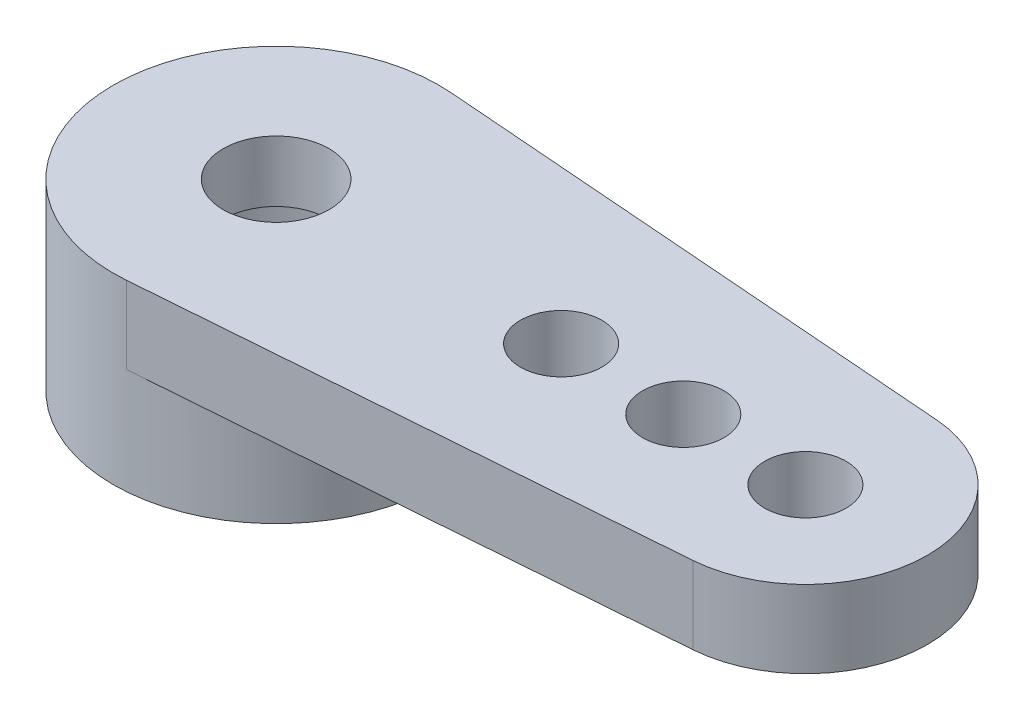
ISO-10303-21;
HEADER;
FILE_DESCRIPTION(('STEP AP214'),'2;1');
FILE_NAME('part.step','',(''),(''),'','','');
FILE_SCHEMA(('AUTOMOTIVE_DESIGN { 1 0 10303 214 1 1 1 1 }'));
ENDSEC;
DATA;
#1=APPLICATION_CONTEXT('core data for automotive mechanical design processes');
#2=APPLICATION_PROTOCOL_DEFINITION('international standard','automotive_design',2000,#1);
#3=PRODUCT_CONTEXT('',#1,'mechanical');
#4=PRODUCT('Part','Part','',(#3));
#5=PRODUCT_RELATED_PRODUCT_CATEGORY('part','',(#4));
#6=PRODUCT_DEFINITION_FORMATION('','',#4);
#7=PRODUCT_DEFINITION_CONTEXT('part definition',#1,'design');
#8=PRODUCT_DEFINITION('design','',#6,#7);
#9=PRODUCT_DEFINITION_SHAPE('','',#8);
#10=(LENGTH_UNIT() NAMED_UNIT(*) SI_UNIT(.MILLI.,.METRE.));
#11=(NAMED_UNIT(*) PLANE_ANGLE_UNIT() SI_UNIT($,.RADIAN.));
#12=(NAMED_UNIT(*) SI_UNIT($,.STERADIAN.) SOLID_ANGLE_UNIT());
#13=UNCERTAINTY_MEASURE_WITH_UNIT(LENGTH_MEASURE(1.E-05),#10,'distance_accuracy_value','');
#14=(GEOMETRIC_REPRESENTATION_CONTEXT(3) GLOBAL_UNCERTAINTY_ASSIGNED_CONTEXT((#13)) GLOBAL_UNIT_ASSIGNED_CONTEXT((#10,
#11,#12)) REPRESENTATION_CONTEXT('',''));
#15=CARTESIAN_POINT('',(0.,0.,0.));
#16=DIRECTION('',(0.,0.,1.));
#17=DIRECTION('',(1.,0.,0.));
#18=AXIS2_PLACEMENT_3D('',#15,#16,#17);
#19=CARTESIAN_POINT('',(0.,4.5,0.));
#20=DIRECTION('',(0.,-1.,0.));
#21=DIRECTION('',(0.,0.,-1.));
#22=AXIS2_PLACEMENT_3D('',#19,#20,#21);
#23=CYLINDRICAL_SURFACE('',#22,1.3);
#24=CARTESIAN_POINT('',(0.,4.5,0.));
#25=DIRECTION('',(0.,1.,0.));
#26=DIRECTION('',(0.,0.,1.));
#27=AXIS2_PLACEMENT_3D('',#24,#25,#26);
#28=CIRCLE('',#27,1.3);
#29=CARTESIAN_POINT('',(0.,4.5,1.3));
#30=VERTEX_POINT('',#29);
#31=EDGE_CURVE('E135',#30,#30,#28,.T.);
#32=ORIENTED_EDGE('',*,*,#31,.T.);
#33=EDGE_LOOP('',(#32));
#34=FACE_BOUND('',#33,.T.);
#35=CARTESIAN_POINT('',(0.,3.,0.));
#36=DIRECTION('',(0.,-1.,0.));
#37=DIRECTION('',(0.,0.,-1.));
#38=AXIS2_PLACEMENT_3D('',#35,#36,#37);
#39=CIRCLE('',#38,1.3);
#40=CARTESIAN_POINT('',(0.,3.,-1.3));
#41=VERTEX_POINT('',#40);
#42=EDGE_CURVE('E47',#41,#41,#39,.T.);
#43=ORIENTED_EDGE('',*,*,#42,.T.);
#44=EDGE_LOOP('',(#43));
#45=FACE_BOUND('',#44,.T.);
#46=ADVANCED_FACE('F43',(#34,#45),#23,.F.);
#47=CARTESIAN_POINT('',(0.,4.5,0.));
#48=DIRECTION('',(0.,1.,0.));
#49=DIRECTION('',(0.,0.,1.));
#50=AXIS2_PLACEMENT_3D('',#47,#48,#49);
#51=PLANE('',#50);
#52=CARTESIAN_POINT('',(0.,4.5,0.));
#53=DIRECTION('',(0.,1.,0.));
#54=DIRECTION('',(0.,0.,1.));
#55=AXIS2_PLACEMENT_3D('',#52,#53,#54);
#56=CIRCLE('',#55,4.);
#57=CARTESIAN_POINT('',(0.307692307692308,4.5,-3.98814812209715));
#58=VERTEX_POINT('',#57);
#59=CARTESIAN_POINT('',(0.307692307692308,4.5,3.98814812209715));
#60=VERTEX_POINT('',#59);
#61=EDGE_CURVE('E11',#58,#60,#56,.T.);
#62=ORIENTED_EDGE('',*,*,#61,.T.);
#63=DIRECTION('',(0.997037030524286,0.,-0.076923076923077));
#64=VECTOR('',#63,1.);
#65=CARTESIAN_POINT('',(0.307692307692308,4.5,3.98814812209715));
#66=LINE('',#65,#64);
#67=CARTESIAN_POINT('',(13.2307692307692,4.5,2.99111109157286));
#68=VERTEX_POINT('',#67);
#69=EDGE_CURVE('E99',#60,#68,#66,.T.);
#70=ORIENTED_EDGE('',*,*,#69,.T.);
#71=CARTESIAN_POINT('',(13.,4.5,0.));
#72=DIRECTION('',(0.,1.,0.));
#73=DIRECTION('',(0.,0.,1.));
#74=AXIS2_PLACEMENT_3D('',#71,#72,#73);
#75=CIRCLE('',#74,3.);
#76=CARTESIAN_POINT('',(13.2307692307692,4.5,-2.99111109157286));
#77=VERTEX_POINT('',#76);
#78=EDGE_CURVE('E128',#68,#77,#75,.T.);
#79=ORIENTED_EDGE('',*,*,#78,.T.);
#80=DIRECTION('',(0.997037030524286,0.,0.076923076923077));
#81=VECTOR('',#80,1.);
#82=CARTESIAN_POINT('',(0.307692307692308,4.5,-3.98814812209715));
#83=LINE('',#82,#81);
#84=EDGE_CURVE('E59',#58,#77,#83,.T.);
#85=ORIENTED_EDGE('',*,*,#84,.F.);
#86=EDGE_LOOP('',(#62,#70,#79,#85));
#87=FACE_BOUND('',#86,.T.);
#88=ORIENTED_EDGE('',*,*,#31,.F.);
#89=EDGE_LOOP('',(#88));
#90=FACE_BOUND('',#89,.T.);
#91=CARTESIAN_POINT('',(10.,4.5,0.));
#92=DIRECTION('',(0.,1.,0.));
#93=DIRECTION('',(0.,0.,1.));
#94=AXIS2_PLACEMENT_3D('',#91,#92,#93);
#95=CIRCLE('',#94,1.);
#96=CARTESIAN_POINT('',(10.,4.5,1.));
#97=VERTEX_POINT('',#96);
#98=EDGE_CURVE('E120',#97,#97,#95,.T.);
#99=ORIENTED_EDGE('',*,*,#98,.F.);
#100=EDGE_LOOP('',(#99));
#101=FACE_BOUND('',#100,.T.);
#102=CARTESIAN_POINT('',(7.,4.5,0.));
#103=DIRECTION('',(0.,1.,0.));
#104=DIRECTION('',(0.,0.,1.));
#105=AXIS2_PLACEMENT_3D('',#102,#103,#104);
#106=CIRCLE('',#105,1.);
#107=CARTESIAN_POINT('',(7.,4.5,1.));
#108=VERTEX_POINT('',#107);
#109=EDGE_CURVE('E123',#108,#108,#106,.T.);
#110=ORIENTED_EDGE('',*,*,#109,.F.);
#111=EDGE_LOOP('',(#110));
#112=FACE_BOUND('',#111,.T.);
#113=CARTESIAN_POINT('',(13.,4.5,0.));
#114=DIRECTION('',(0.,1.,0.));
#115=DIRECTION('',(0.,0.,1.));
#116=AXIS2_PLACEMENT_3D('',#113,#114,#115);
#117=CIRCLE('',#116,1.);
#118=CARTESIAN_POINT('',(13.,4.5,1.));
#119=VERTEX_POINT('',#118);
#120=EDGE_CURVE('E130',#119,#119,#117,.T.);
#121=ORIENTED_EDGE('',*,*,#120,.F.);
#122=EDGE_LOOP('',(#121));
#123=FACE_BOUND('',#122,.T.);
#124=ADVANCED_FACE('F144',(#87,#90,#101,#112,#123),#51,.T.);
#125=CARTESIAN_POINT('',(0.,0.,0.));
#126=DIRECTION('',(0.,1.,0.));
#127=DIRECTION('',(0.,0.,1.));
#128=AXIS2_PLACEMENT_3D('',#125,#126,#127);
#129=PLANE('',#128);
#130=CARTESIAN_POINT('',(0.,0.,0.));
#131=DIRECTION('',(0.,-1.,0.));
#132=DIRECTION('',(0.,0.,-1.));
#133=AXIS2_PLACEMENT_3D('',#130,#131,#132);
#134=CIRCLE('',#133,3.);
#135=CARTESIAN_POINT('',(0.,0.,-3.));
#136=VERTEX_POINT('',#135);
#137=EDGE_CURVE('E198',#136,#136,#134,.T.);
#138=ORIENTED_EDGE('',*,*,#137,.F.);
#139=EDGE_LOOP('',(#138));
#140=FACE_BOUND('',#139,.T.);
#141=CARTESIAN_POINT('',(0.,0.,0.));
#142=DIRECTION('',(0.,1.,0.));
#143=DIRECTION('',(0.,0.,1.));
#144=AXIS2_PLACEMENT_3D('',#141,#142,#143);
#145=CIRCLE('',#144,4.);
#146=CARTESIAN_POINT('',(0.,0.,4.));
#147=VERTEX_POINT('',#146);
#148=EDGE_CURVE('E52',#147,#147,#145,.T.);
#149=ORIENTED_EDGE('',*,*,#148,.F.);
#150=EDGE_LOOP('',(#149));
#151=FACE_BOUND('',#150,.T.);
#152=ADVANCED_FACE('F142',(#140,#151),#129,.F.);
#153=CARTESIAN_POINT('',(0.,4.5,0.));
#154=DIRECTION('',(0.,-1.,0.));
#155=DIRECTION('',(0.,0.,-1.));
#156=AXIS2_PLACEMENT_3D('',#153,#154,#155);
#157=CYLINDRICAL_SURFACE('',#156,4.);
#158=ORIENTED_EDGE('',*,*,#61,.F.);
#159=DIRECTION('',(0.,1.,0.));
#160=VECTOR('',#159,1.);
#161=CARTESIAN_POINT('',(0.307692307692308,2.6,-3.98814812209715));
#162=LINE('',#161,#160);
#163=CARTESIAN_POINT('',(0.307692307692308,2.6,-3.98814812209715));
#164=VERTEX_POINT('',#163);
#165=EDGE_CURVE('E103',#164,#58,#162,.T.);
#166=ORIENTED_EDGE('',*,*,#165,.F.);
#167=CARTESIAN_POINT('',(0.,2.6,0.));
#168=DIRECTION('',(0.,1.,0.));
#169=DIRECTION('',(0.,0.,1.));
#170=AXIS2_PLACEMENT_3D('',#167,#168,#169);
#171=CIRCLE('',#170,4.);
#172=CARTESIAN_POINT('',(0.307692307692308,2.6,3.98814812209715));
#173=VERTEX_POINT('',#172);
#174=EDGE_CURVE('E90',#173,#164,#171,.T.);
#175=ORIENTED_EDGE('',*,*,#174,.F.);
#176=DIRECTION('',(0.,1.,0.));
#177=VECTOR('',#176,1.);
#178=CARTESIAN_POINT('',(0.307692307692308,2.6,3.98814812209715));
#179=LINE('',#178,#177);
#180=EDGE_CURVE('E95',#173,#60,#179,.T.);
#181=ORIENTED_EDGE('',*,*,#180,.T.);
#182=EDGE_LOOP('',(#158,#166,#175,#181));
#183=FACE_BOUND('',#182,.T.);
#184=ORIENTED_EDGE('',*,*,#148,.T.);
#185=EDGE_LOOP('',(#184));
#186=FACE_BOUND('',#185,.T.);
#187=ADVANCED_FACE('F45',(#183,#186),#157,.T.);
#188=CARTESIAN_POINT('',(0.307692307692308,2.6,-3.98814812209715));
#189=DIRECTION('',(-0.076923076923077,0.,0.997037030524286));
#190=DIRECTION('',(0.997037030524286,0.,0.076923076923077));
#191=AXIS2_PLACEMENT_3D('',#188,#189,#190);
#192=PLANE('',#191);
#193=ORIENTED_EDGE('',*,*,#84,.T.);
#194=DIRECTION('',(0.,1.,0.));
#195=VECTOR('',#194,1.);
#196=CARTESIAN_POINT('',(13.2307692307692,2.6,-2.99111109157286));
#197=LINE('',#196,#195);
#198=CARTESIAN_POINT('',(13.2307692307692,2.6,-2.99111109157286));
#199=VERTEX_POINT('',#198);
#200=EDGE_CURVE('E86',#199,#77,#197,.T.);
#201=ORIENTED_EDGE('',*,*,#200,.F.);
#202=DIRECTION('',(0.997037030524286,0.,0.076923076923077));
#203=VECTOR('',#202,1.);
#204=CARTESIAN_POINT('',(0.307692307692308,2.6,-3.98814812209715));
#205=LINE('',#204,#203);
#206=EDGE_CURVE('E68',#164,#199,#205,.T.);
#207=ORIENTED_EDGE('',*,*,#206,.F.);
#208=ORIENTED_EDGE('',*,*,#165,.T.);
#209=EDGE_LOOP('',(#193,#201,#207,#208));
#210=FACE_BOUND('',#209,.T.);
#211=ADVANCED_FACE('F151',(#210),#192,.F.);
#212=CARTESIAN_POINT('',(13.,2.6,0.));
#213=DIRECTION('',(0.,1.,0.));
#214=DIRECTION('',(0.,0.,1.));
#215=AXIS2_PLACEMENT_3D('',#212,#213,#214);
#216=CYLINDRICAL_SURFACE('',#215,3.);
#217=ORIENTED_EDGE('',*,*,#78,.F.);
#218=DIRECTION('',(0.,1.,0.));
#219=VECTOR('',#218,1.);
#220=CARTESIAN_POINT('',(13.2307692307692,2.6,2.99111109157286));
#221=LINE('',#220,#219);
#222=CARTESIAN_POINT('',(13.2307692307692,2.6,2.99111109157286));
#223=VERTEX_POINT('',#222);
#224=EDGE_CURVE('E102',#223,#68,#221,.T.);
#225=ORIENTED_EDGE('',*,*,#224,.F.);
#226=CARTESIAN_POINT('',(13.,2.6,0.));
#227=DIRECTION('',(0.,1.,0.));
#228=DIRECTION('',(0.,0.,1.));
#229=AXIS2_PLACEMENT_3D('',#226,#227,#228);
#230=CIRCLE('',#229,3.);
#231=EDGE_CURVE('E107',#223,#199,#230,.T.);
#232=ORIENTED_EDGE('',*,*,#231,.T.);
#233=ORIENTED_EDGE('',*,*,#200,.T.);
#234=EDGE_LOOP('',(#217,#225,#232,#233));
#235=FACE_BOUND('',#234,.T.);
#236=ADVANCED_FACE('F173',(#235),#216,.T.);
#237=CARTESIAN_POINT('',(0.307692307692308,2.6,3.98814812209715));
#238=DIRECTION('',(0.076923076923077,0.,0.997037030524286));
#239=DIRECTION('',(0.997037030524286,0.,-0.076923076923077));
#240=AXIS2_PLACEMENT_3D('',#237,#238,#239);
#241=PLANE('',#240);
#242=ORIENTED_EDGE('',*,*,#69,.F.);
#243=ORIENTED_EDGE('',*,*,#180,.F.);
#244=DIRECTION('',(0.997037030524286,0.,-0.076923076923077));
#245=VECTOR('',#244,1.);
#246=CARTESIAN_POINT('',(0.307692307692308,2.6,3.98814812209715));
#247=LINE('',#246,#245);
#248=EDGE_CURVE('E97',#173,#223,#247,.T.);
#249=ORIENTED_EDGE('',*,*,#248,.T.);
#250=ORIENTED_EDGE('',*,*,#224,.T.);
#251=EDGE_LOOP('',(#242,#243,#249,#250));
#252=FACE_BOUND('',#251,.T.);
#253=ADVANCED_FACE('F96',(#252),#241,.T.);
#254=CARTESIAN_POINT('',(7.,2.6,0.));
#255=DIRECTION('',(0.,1.,0.));
#256=DIRECTION('',(0.,0.,1.));
#257=AXIS2_PLACEMENT_3D('',#254,#255,#256);
#258=CYLINDRICAL_SURFACE('',#257,1.);
#259=CARTESIAN_POINT('',(7.,2.6,0.));
#260=DIRECTION('',(0.,1.,0.));
#261=DIRECTION('',(0.,0.,1.));
#262=AXIS2_PLACEMENT_3D('',#259,#260,#261);
#263=CIRCLE('',#262,1.);
#264=CARTESIAN_POINT('',(7.,2.6,1.));
#265=VERTEX_POINT('',#264);
#266=EDGE_CURVE('E112',#265,#265,#263,.T.);
#267=ORIENTED_EDGE('',*,*,#266,.F.);
#268=EDGE_LOOP('',(#267));
#269=FACE_BOUND('',#268,.T.);
#270=ORIENTED_EDGE('',*,*,#109,.T.);
#271=EDGE_LOOP('',(#270));
#272=FACE_BOUND('',#271,.T.);
#273=ADVANCED_FACE('F166',(#269,#272),#258,.F.);
#274=CARTESIAN_POINT('',(10.,2.6,0.));
#275=DIRECTION('',(0.,1.,0.));
#276=DIRECTION('',(0.,0.,1.));
#277=AXIS2_PLACEMENT_3D('',#274,#275,#276);
#278=CYLINDRICAL_SURFACE('',#277,1.);
#279=CARTESIAN_POINT('',(10.,2.6,0.));
#280=DIRECTION('',(0.,1.,0.));
#281=DIRECTION('',(0.,0.,1.));
#282=AXIS2_PLACEMENT_3D('',#279,#280,#281);
#283=CIRCLE('',#282,1.);
#284=CARTESIAN_POINT('',(10.,2.6,1.));
#285=VERTEX_POINT('',#284);
#286=EDGE_CURVE('E133',#285,#285,#283,.T.);
#287=ORIENTED_EDGE('',*,*,#286,.F.);
#288=EDGE_LOOP('',(#287));
#289=FACE_BOUND('',#288,.T.);
#290=ORIENTED_EDGE('',*,*,#98,.T.);
#291=EDGE_LOOP('',(#290));
#292=FACE_BOUND('',#291,.T.);
#293=ADVANCED_FACE('F162',(#289,#292),#278,.F.);
#294=CARTESIAN_POINT('',(13.,2.6,0.));
#295=DIRECTION('',(0.,1.,0.));
#296=DIRECTION('',(0.,0.,1.));
#297=AXIS2_PLACEMENT_3D('',#294,#295,#296);
#298=CYLINDRICAL_SURFACE('',#297,1.);
#299=CARTESIAN_POINT('',(13.,2.6,0.));
#300=DIRECTION('',(0.,1.,0.));
#301=DIRECTION('',(0.,0.,1.));
#302=AXIS2_PLACEMENT_3D('',#299,#300,#301);
#303=CIRCLE('',#302,1.);
#304=CARTESIAN_POINT('',(13.,2.6,1.));
#305=VERTEX_POINT('',#304);
#306=EDGE_CURVE('E117',#305,#305,#303,.T.);
#307=ORIENTED_EDGE('',*,*,#306,.F.);
#308=EDGE_LOOP('',(#307));
#309=FACE_BOUND('',#308,.T.);
#310=ORIENTED_EDGE('',*,*,#120,.T.);
#311=EDGE_LOOP('',(#310));
#312=FACE_BOUND('',#311,.T.);
#313=ADVANCED_FACE('F165',(#309,#312),#298,.F.);
#314=CARTESIAN_POINT('',(0.,2.6,0.));
#315=DIRECTION('',(0.,1.,0.));
#316=DIRECTION('',(0.,0.,1.));
#317=AXIS2_PLACEMENT_3D('',#314,#315,#316);
#318=PLANE('',#317);
#319=ORIENTED_EDGE('',*,*,#286,.T.);
#320=EDGE_LOOP('',(#319));
#321=FACE_BOUND('',#320,.T.);
#322=ORIENTED_EDGE('',*,*,#266,.T.);
#323=EDGE_LOOP('',(#322));
#324=FACE_BOUND('',#323,.T.);
#325=ORIENTED_EDGE('',*,*,#206,.T.);
#326=ORIENTED_EDGE('',*,*,#231,.F.);
#327=ORIENTED_EDGE('',*,*,#248,.F.);
#328=ORIENTED_EDGE('',*,*,#174,.T.);
#329=EDGE_LOOP('',(#325,#326,#327,#328));
#330=FACE_BOUND('',#329,.T.);
#331=ORIENTED_EDGE('',*,*,#306,.T.);
#332=EDGE_LOOP('',(#331));
#333=FACE_BOUND('',#332,.T.);
#334=ADVANCED_FACE('F105',(#321,#324,#330,#333),#318,.F.);
#335=CARTESIAN_POINT('',(0.,3.,0.));
#336=DIRECTION('',(0.,-1.,0.));
#337=DIRECTION('',(0.,0.,-1.));
#338=AXIS2_PLACEMENT_3D('',#335,#336,#337);
#339=CYLINDRICAL_SURFACE('',#338,3.);
#340=CARTESIAN_POINT('',(0.,3.,0.));
#341=DIRECTION('',(0.,-1.,0.));
#342=DIRECTION('',(0.,0.,-1.));
#343=AXIS2_PLACEMENT_3D('',#340,#341,#342);
#344=CIRCLE('',#343,3.);
#345=CARTESIAN_POINT('',(0.,3.,-3.));
#346=VERTEX_POINT('',#345);
#347=EDGE_CURVE('E197',#346,#346,#344,.T.);
#348=ORIENTED_EDGE('',*,*,#347,.F.);
#349=EDGE_LOOP('',(#348));
#350=FACE_BOUND('',#349,.T.);
#351=ORIENTED_EDGE('',*,*,#137,.T.);
#352=EDGE_LOOP('',(#351));
#353=FACE_BOUND('',#352,.T.);
#354=ADVANCED_FACE('F183',(#350,#353),#339,.F.);
#355=CARTESIAN_POINT('',(0.,3.,0.));
#356=DIRECTION('',(0.,-1.,0.));
#357=DIRECTION('',(0.,0.,-1.));
#358=AXIS2_PLACEMENT_3D('',#355,#356,#357);
#359=PLANE('',#358);
#360=ORIENTED_EDGE('',*,*,#42,.F.);
#361=EDGE_LOOP('',(#360));
#362=FACE_BOUND('',#361,.T.);
#363=ORIENTED_EDGE('',*,*,#347,.T.);
#364=EDGE_LOOP('',(#363));
#365=FACE_BOUND('',#364,.T.);
#366=ADVANCED_FACE('F186',(#362,#365),#359,.T.);
#367=CLOSED_SHELL('',(#46,#124,#152,#187,#211,#236,#253,#273,#293,#313,#334,#354,#366));
#368=MANIFOLD_SOLID_BREP('B2',#367);
#369=ADVANCED_BREP_SHAPE_REPRESENTATION('',(#18,#368),#14);
#370=SHAPE_DEFINITION_REPRESENTATION(#9,#369);
ENDSEC;
END-ISO-10303-21;
